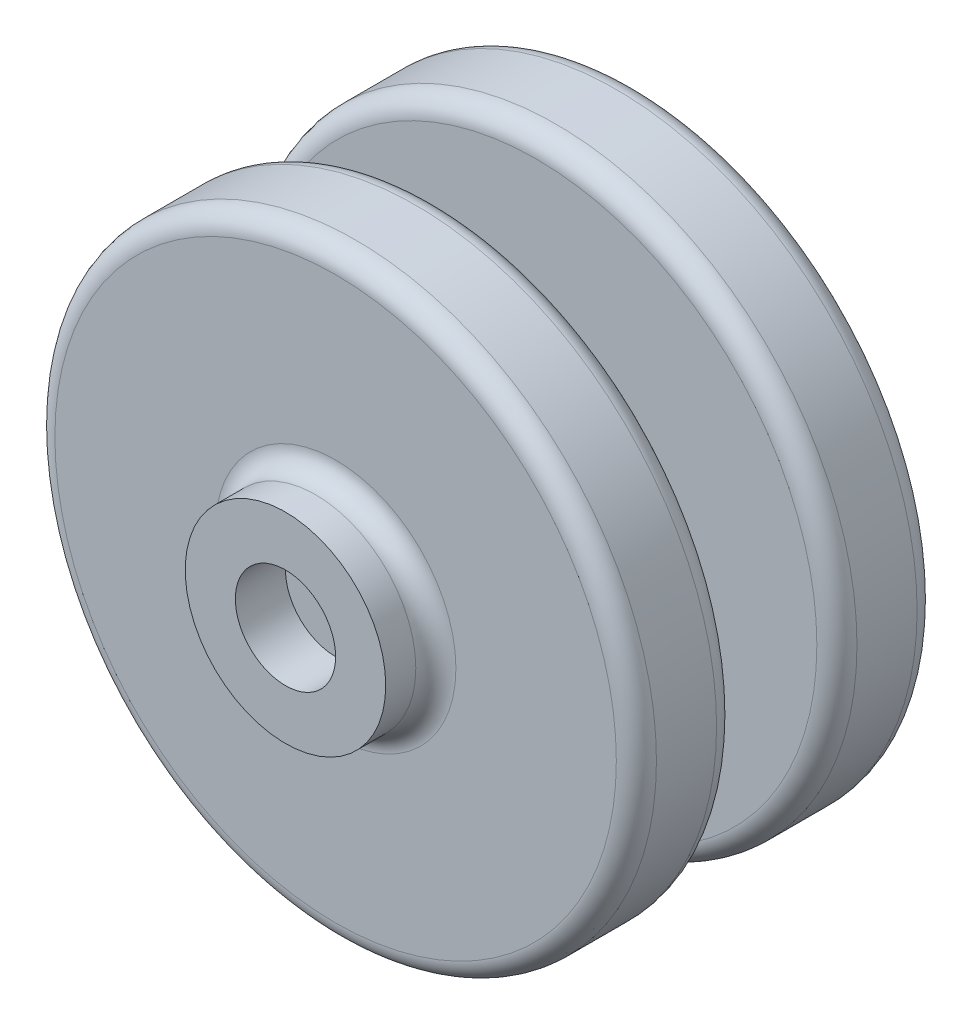
ISO-10303-21;
HEADER;
FILE_DESCRIPTION(('STEP AP214'),'2;1');
FILE_NAME('part.step','',(''),(''),'','','');
FILE_SCHEMA(('AUTOMOTIVE_DESIGN { 1 0 10303 214 1 1 1 1 }'));
ENDSEC;
DATA;
#1=APPLICATION_CONTEXT('core data for automotive mechanical design processes');
#2=APPLICATION_PROTOCOL_DEFINITION('international standard','automotive_design',2000,#1);
#3=PRODUCT_CONTEXT('',#1,'mechanical');
#4=PRODUCT('Part','Part','',(#3));
#5=PRODUCT_RELATED_PRODUCT_CATEGORY('part','',(#4));
#6=PRODUCT_DEFINITION_FORMATION('','',#4);
#7=PRODUCT_DEFINITION_CONTEXT('part definition',#1,'design');
#8=PRODUCT_DEFINITION('design','',#6,#7);
#9=PRODUCT_DEFINITION_SHAPE('','',#8);
#10=(LENGTH_UNIT() NAMED_UNIT(*) SI_UNIT(.MILLI.,.METRE.));
#11=(NAMED_UNIT(*) PLANE_ANGLE_UNIT() SI_UNIT($,.RADIAN.));
#12=(NAMED_UNIT(*) SI_UNIT($,.STERADIAN.) SOLID_ANGLE_UNIT());
#13=UNCERTAINTY_MEASURE_WITH_UNIT(LENGTH_MEASURE(1.E-05),#10,'distance_accuracy_value','');
#14=(GEOMETRIC_REPRESENTATION_CONTEXT(3) GLOBAL_UNCERTAINTY_ASSIGNED_CONTEXT((#13)) GLOBAL_UNIT_ASSIGNED_CONTEXT((#10,
#11,#12)) REPRESENTATION_CONTEXT('',''));
#15=CARTESIAN_POINT('',(0.,0.,0.));
#16=DIRECTION('',(0.,0.,1.));
#17=DIRECTION('',(1.,0.,0.));
#18=AXIS2_PLACEMENT_3D('',#15,#16,#17);
#19=CARTESIAN_POINT('',(0.,0.,10.));
#20=DIRECTION('',(0.,0.,-1.));
#21=DIRECTION('',(-1.,0.,0.));
#22=AXIS2_PLACEMENT_3D('',#19,#20,#21);
#23=CYLINDRICAL_SURFACE('',#22,30.);
#24=CARTESIAN_POINT('',(0.,0.,8.));
#25=DIRECTION('',(0.,0.,1.));
#26=DIRECTION('',(1.,0.,0.));
#27=AXIS2_PLACEMENT_3D('',#24,#25,#26);
#28=CIRCLE('',#27,30.);
#29=CARTESIAN_POINT('',(30.,0.,8.));
#30=VERTEX_POINT('',#29);
#31=EDGE_CURVE('E45',#30,#30,#28,.F.);
#32=ORIENTED_EDGE('',*,*,#31,.T.);
#33=EDGE_LOOP('',(#32));
#34=FACE_BOUND('',#33,.T.);
#35=CARTESIAN_POINT('',(0.,0.,2.));
#36=DIRECTION('',(0.,0.,1.));
#37=DIRECTION('',(1.,0.,0.));
#38=AXIS2_PLACEMENT_3D('',#35,#36,#37);
#39=CIRCLE('',#38,30.);
#40=CARTESIAN_POINT('',(30.,0.,2.));
#41=VERTEX_POINT('',#40);
#42=EDGE_CURVE('E49',#41,#41,#39,.T.);
#43=ORIENTED_EDGE('',*,*,#42,.T.);
#44=EDGE_LOOP('',(#43));
#45=FACE_BOUND('',#44,.T.);
#46=ADVANCED_FACE('F38',(#34,#45),#23,.T.);
#47=CARTESIAN_POINT('',(0.,0.,10.));
#48=DIRECTION('',(0.,0.,1.));
#49=DIRECTION('',(1.,0.,0.));
#50=AXIS2_PLACEMENT_3D('',#47,#48,#49);
#51=PLANE('',#50);
#52=CARTESIAN_POINT('',(0.,0.,10.));
#53=DIRECTION('',(0.,0.,1.));
#54=DIRECTION('',(1.,0.,0.));
#55=AXIS2_PLACEMENT_3D('',#52,#53,#54);
#56=CIRCLE('',#55,28.);
#57=CARTESIAN_POINT('',(28.,0.,10.));
#58=VERTEX_POINT('',#57);
#59=EDGE_CURVE('E53',#58,#58,#56,.T.);
#60=ORIENTED_EDGE('',*,*,#59,.T.);
#61=EDGE_LOOP('',(#60));
#62=FACE_BOUND('',#61,.T.);
#63=CARTESIAN_POINT('',(0.,0.,10.));
#64=DIRECTION('',(0.,0.,1.));
#65=DIRECTION('',(1.,0.,0.));
#66=AXIS2_PLACEMENT_3D('',#63,#64,#65);
#67=CIRCLE('',#66,5.);
#68=CARTESIAN_POINT('',(5.,0.,10.));
#69=VERTEX_POINT('',#68);
#70=EDGE_CURVE('E88',#69,#69,#67,.T.);
#71=ORIENTED_EDGE('',*,*,#70,.F.);
#72=EDGE_LOOP('',(#71));
#73=FACE_BOUND('',#72,.T.);
#74=ADVANCED_FACE('F131',(#62,#73),#51,.T.);
#75=CARTESIAN_POINT('',(0.,0.,0.));
#76=DIRECTION('',(0.,0.,1.));
#77=DIRECTION('',(1.,0.,0.));
#78=AXIS2_PLACEMENT_3D('',#75,#76,#77);
#79=PLANE('',#78);
#80=CARTESIAN_POINT('',(0.,0.,0.));
#81=DIRECTION('',(0.,0.,1.));
#82=DIRECTION('',(1.,0.,0.));
#83=AXIS2_PLACEMENT_3D('',#80,#81,#82);
#84=CIRCLE('',#83,28.);
#85=CARTESIAN_POINT('',(28.,0.,0.));
#86=VERTEX_POINT('',#85);
#87=EDGE_CURVE('E10',#86,#86,#84,.F.);
#88=ORIENTED_EDGE('',*,*,#87,.T.);
#89=EDGE_LOOP('',(#88));
#90=FACE_BOUND('',#89,.T.);
#91=CARTESIAN_POINT('',(0.,0.,0.));
#92=DIRECTION('',(0.,0.,1.));
#93=DIRECTION('',(1.,0.,0.));
#94=AXIS2_PLACEMENT_3D('',#91,#92,#93);
#95=CIRCLE('',#94,12.);
#96=CARTESIAN_POINT('',(12.,0.,0.));
#97=VERTEX_POINT('',#96);
#98=EDGE_CURVE('E79',#97,#97,#95,.T.);
#99=ORIENTED_EDGE('',*,*,#98,.T.);
#100=EDGE_LOOP('',(#99));
#101=FACE_BOUND('',#100,.T.);
#102=ADVANCED_FACE('F120',(#90,#101),#79,.F.);
#103=CARTESIAN_POINT('',(0.,0.,20.));
#104=DIRECTION('',(0.,0.,-1.));
#105=DIRECTION('',(-1.,0.,0.));
#106=AXIS2_PLACEMENT_3D('',#103,#104,#105);
#107=CYLINDRICAL_SURFACE('',#106,5.);
#108=CARTESIAN_POINT('',(0.,0.,20.));
#109=DIRECTION('',(0.,0.,1.));
#110=DIRECTION('',(1.,0.,0.));
#111=AXIS2_PLACEMENT_3D('',#108,#109,#110);
#112=CIRCLE('',#111,5.);
#113=CARTESIAN_POINT('',(5.,0.,20.));
#114=VERTEX_POINT('',#113);
#115=EDGE_CURVE('E91',#114,#114,#112,.T.);
#116=ORIENTED_EDGE('',*,*,#115,.F.);
#117=EDGE_LOOP('',(#116));
#118=FACE_BOUND('',#117,.T.);
#119=ORIENTED_EDGE('',*,*,#70,.T.);
#120=EDGE_LOOP('',(#119));
#121=FACE_BOUND('',#120,.T.);
#122=ADVANCED_FACE('F130',(#118,#121),#107,.T.);
#123=CARTESIAN_POINT('',(0.,0.,30.));
#124=DIRECTION('',(0.,0.,-1.));
#125=DIRECTION('',(-1.,0.,0.));
#126=AXIS2_PLACEMENT_3D('',#123,#124,#125);
#127=CYLINDRICAL_SURFACE('',#126,30.);
#128=CARTESIAN_POINT('',(0.,0.,28.));
#129=DIRECTION('',(0.,0.,1.));
#130=DIRECTION('',(1.,0.,0.));
#131=AXIS2_PLACEMENT_3D('',#128,#129,#130);
#132=CIRCLE('',#131,30.);
#133=CARTESIAN_POINT('',(30.,0.,28.));
#134=VERTEX_POINT('',#133);
#135=EDGE_CURVE('E61',#134,#134,#132,.F.);
#136=ORIENTED_EDGE('',*,*,#135,.T.);
#137=EDGE_LOOP('',(#136));
#138=FACE_BOUND('',#137,.T.);
#139=CARTESIAN_POINT('',(0.,0.,22.));
#140=DIRECTION('',(0.,0.,1.));
#141=DIRECTION('',(1.,0.,0.));
#142=AXIS2_PLACEMENT_3D('',#139,#140,#141);
#143=CIRCLE('',#142,30.);
#144=CARTESIAN_POINT('',(30.,0.,22.));
#145=VERTEX_POINT('',#144);
#146=EDGE_CURVE('E64',#145,#145,#143,.T.);
#147=ORIENTED_EDGE('',*,*,#146,.T.);
#148=EDGE_LOOP('',(#147));
#149=FACE_BOUND('',#148,.T.);
#150=ADVANCED_FACE('F162',(#138,#149),#127,.T.);
#151=CARTESIAN_POINT('',(0.,0.,30.));
#152=DIRECTION('',(0.,0.,1.));
#153=DIRECTION('',(1.,0.,0.));
#154=AXIS2_PLACEMENT_3D('',#151,#152,#153);
#155=PLANE('',#154);
#156=CARTESIAN_POINT('',(0.,0.,30.));
#157=DIRECTION('',(0.,0.,1.));
#158=DIRECTION('',(1.,0.,0.));
#159=AXIS2_PLACEMENT_3D('',#156,#157,#158);
#160=CIRCLE('',#159,28.);
#161=CARTESIAN_POINT('',(28.,0.,30.));
#162=VERTEX_POINT('',#161);
#163=EDGE_CURVE('E67',#162,#162,#160,.T.);
#164=ORIENTED_EDGE('',*,*,#163,.T.);
#165=EDGE_LOOP('',(#164));
#166=FACE_BOUND('',#165,.T.);
#167=CARTESIAN_POINT('',(0.,0.,30.));
#168=DIRECTION('',(0.,0.,1.));
#169=DIRECTION('',(1.,0.,0.));
#170=AXIS2_PLACEMENT_3D('',#167,#168,#169);
#171=CIRCLE('',#170,12.);
#172=CARTESIAN_POINT('',(12.,0.,30.));
#173=VERTEX_POINT('',#172);
#174=EDGE_CURVE('E70',#173,#173,#171,.F.);
#175=ORIENTED_EDGE('',*,*,#174,.T.);
#176=EDGE_LOOP('',(#175));
#177=FACE_BOUND('',#176,.T.);
#178=ADVANCED_FACE('F168',(#166,#177),#155,.T.);
#179=CARTESIAN_POINT('',(0.,0.,20.));
#180=DIRECTION('',(0.,0.,1.));
#181=DIRECTION('',(1.,0.,0.));
#182=AXIS2_PLACEMENT_3D('',#179,#180,#181);
#183=PLANE('',#182);
#184=CARTESIAN_POINT('',(0.,0.,20.));
#185=DIRECTION('',(0.,0.,1.));
#186=DIRECTION('',(1.,0.,0.));
#187=AXIS2_PLACEMENT_3D('',#184,#185,#186);
#188=CIRCLE('',#187,28.);
#189=CARTESIAN_POINT('',(28.,0.,20.));
#190=VERTEX_POINT('',#189);
#191=EDGE_CURVE('E58',#190,#190,#188,.F.);
#192=ORIENTED_EDGE('',*,*,#191,.T.);
#193=EDGE_LOOP('',(#192));
#194=FACE_BOUND('',#193,.T.);
#195=ORIENTED_EDGE('',*,*,#115,.T.);
#196=EDGE_LOOP('',(#195));
#197=FACE_BOUND('',#196,.T.);
#198=ADVANCED_FACE('F173',(#194,#197),#183,.F.);
#199=CARTESIAN_POINT('',(0.,0.,35.));
#200=DIRECTION('',(0.,0.,1.));
#201=DIRECTION('',(1.,0.,0.));
#202=AXIS2_PLACEMENT_3D('',#199,#200,#201);
#203=PLANE('',#202);
#204=CARTESIAN_POINT('',(0.,0.,35.));
#205=DIRECTION('',(0.,0.,1.));
#206=DIRECTION('',(1.,0.,0.));
#207=AXIS2_PLACEMENT_3D('',#204,#205,#206);
#208=CIRCLE('',#207,10.);
#209=CARTESIAN_POINT('',(10.,0.,35.));
#210=VERTEX_POINT('',#209);
#211=EDGE_CURVE('E94',#210,#210,#208,.T.);
#212=ORIENTED_EDGE('',*,*,#211,.T.);
#213=EDGE_LOOP('',(#212));
#214=FACE_BOUND('',#213,.T.);
#215=CARTESIAN_POINT('',(0.,0.,35.));
#216=DIRECTION('',(0.,0.,1.));
#217=DIRECTION('',(1.,0.,0.));
#218=AXIS2_PLACEMENT_3D('',#215,#216,#217);
#219=CIRCLE('',#218,5.);
#220=CARTESIAN_POINT('',(5.,0.,35.));
#221=VERTEX_POINT('',#220);
#222=EDGE_CURVE('E97',#221,#221,#219,.T.);
#223=ORIENTED_EDGE('',*,*,#222,.F.);
#224=EDGE_LOOP('',(#223));
#225=FACE_BOUND('',#224,.T.);
#226=ADVANCED_FACE('F176',(#214,#225),#203,.T.);
#227=CARTESIAN_POINT('',(0.,0.,35.));
#228=DIRECTION('',(0.,0.,-1.));
#229=DIRECTION('',(-1.,0.,0.));
#230=AXIS2_PLACEMENT_3D('',#227,#228,#229);
#231=CYLINDRICAL_SURFACE('',#230,10.);
#232=CARTESIAN_POINT('',(0.,0.,32.));
#233=DIRECTION('',(0.,0.,1.));
#234=DIRECTION('',(1.,0.,0.));
#235=AXIS2_PLACEMENT_3D('',#232,#233,#234);
#236=CIRCLE('',#235,10.);
#237=CARTESIAN_POINT('',(10.,0.,32.));
#238=VERTEX_POINT('',#237);
#239=EDGE_CURVE('E73',#238,#238,#236,.T.);
#240=ORIENTED_EDGE('',*,*,#239,.T.);
#241=EDGE_LOOP('',(#240));
#242=FACE_BOUND('',#241,.T.);
#243=ORIENTED_EDGE('',*,*,#211,.F.);
#244=EDGE_LOOP('',(#243));
#245=FACE_BOUND('',#244,.T.);
#246=ADVANCED_FACE('F182',(#242,#245),#231,.T.);
#247=CARTESIAN_POINT('',(0.,0.,35.));
#248=DIRECTION('',(0.,0.,-1.));
#249=DIRECTION('',(-1.,0.,0.));
#250=AXIS2_PLACEMENT_3D('',#247,#248,#249);
#251=CYLINDRICAL_SURFACE('',#250,5.);
#252=ORIENTED_EDGE('',*,*,#222,.T.);
#253=EDGE_LOOP('',(#252));
#254=FACE_BOUND('',#253,.T.);
#255=CARTESIAN_POINT('',(0.,0.,30.));
#256=DIRECTION('',(0.,0.,1.));
#257=DIRECTION('',(1.,0.,0.));
#258=AXIS2_PLACEMENT_3D('',#255,#256,#257);
#259=CIRCLE('',#258,5.);
#260=CARTESIAN_POINT('',(5.,0.,30.));
#261=VERTEX_POINT('',#260);
#262=EDGE_CURVE('E85',#261,#261,#259,.F.);
#263=ORIENTED_EDGE('',*,*,#262,.T.);
#264=EDGE_LOOP('',(#263));
#265=FACE_BOUND('',#264,.T.);
#266=ADVANCED_FACE('F185',(#254,#265),#251,.F.);
#267=ORIENTED_EDGE('',*,*,#262,.F.);
#268=EDGE_LOOP('',(#267));
#269=FACE_BOUND('',#268,.T.);
#270=ADVANCED_FACE('F181',(#269),#155,.T.);
#271=CARTESIAN_POINT('',(0.,0.,-5.));
#272=DIRECTION('',(0.,0.,1.));
#273=DIRECTION('',(1.,0.,0.));
#274=AXIS2_PLACEMENT_3D('',#271,#272,#273);
#275=CYLINDRICAL_SURFACE('',#274,10.);
#276=CARTESIAN_POINT('',(0.,0.,-2.));
#277=DIRECTION('',(0.,0.,1.));
#278=DIRECTION('',(1.,0.,0.));
#279=AXIS2_PLACEMENT_3D('',#276,#277,#278);
#280=CIRCLE('',#279,10.);
#281=CARTESIAN_POINT('',(10.,0.,-2.));
#282=VERTEX_POINT('',#281);
#283=EDGE_CURVE('E76',#282,#282,#280,.F.);
#284=ORIENTED_EDGE('',*,*,#283,.T.);
#285=EDGE_LOOP('',(#284));
#286=FACE_BOUND('',#285,.T.);
#287=CARTESIAN_POINT('',(0.,0.,-5.));
#288=DIRECTION('',(0.,0.,1.));
#289=DIRECTION('',(1.,0.,0.));
#290=AXIS2_PLACEMENT_3D('',#287,#288,#289);
#291=CIRCLE('',#290,10.);
#292=CARTESIAN_POINT('',(10.,0.,-5.));
#293=VERTEX_POINT('',#292);
#294=EDGE_CURVE('E100',#293,#293,#291,.T.);
#295=ORIENTED_EDGE('',*,*,#294,.T.);
#296=EDGE_LOOP('',(#295));
#297=FACE_BOUND('',#296,.T.);
#298=ADVANCED_FACE('F193',(#286,#297),#275,.T.);
#299=CARTESIAN_POINT('',(0.,0.,-5.));
#300=DIRECTION('',(0.,0.,-1.));
#301=DIRECTION('',(1.,0.,0.));
#302=AXIS2_PLACEMENT_3D('',#299,#300,#301);
#303=PLANE('',#302);
#304=CARTESIAN_POINT('',(0.,0.,-5.));
#305=DIRECTION('',(0.,0.,1.));
#306=DIRECTION('',(1.,0.,0.));
#307=AXIS2_PLACEMENT_3D('',#304,#305,#306);
#308=CIRCLE('',#307,5.);
#309=CARTESIAN_POINT('',(5.,0.,-5.));
#310=VERTEX_POINT('',#309);
#311=EDGE_CURVE('E103',#310,#310,#308,.T.);
#312=ORIENTED_EDGE('',*,*,#311,.T.);
#313=EDGE_LOOP('',(#312));
#314=FACE_BOUND('',#313,.T.);
#315=ORIENTED_EDGE('',*,*,#294,.F.);
#316=EDGE_LOOP('',(#315));
#317=FACE_BOUND('',#316,.T.);
#318=ADVANCED_FACE('F107',(#314,#317),#303,.T.);
#319=CARTESIAN_POINT('',(0.,0.,-5.));
#320=DIRECTION('',(0.,0.,1.));
#321=DIRECTION('',(1.,0.,0.));
#322=AXIS2_PLACEMENT_3D('',#319,#320,#321);
#323=CYLINDRICAL_SURFACE('',#322,5.);
#324=ORIENTED_EDGE('',*,*,#311,.F.);
#325=EDGE_LOOP('',(#324));
#326=FACE_BOUND('',#325,.T.);
#327=CARTESIAN_POINT('',(0.,0.,0.));
#328=DIRECTION('',(0.,0.,1.));
#329=DIRECTION('',(1.,0.,0.));
#330=AXIS2_PLACEMENT_3D('',#327,#328,#329);
#331=CIRCLE('',#330,5.);
#332=CARTESIAN_POINT('',(5.,0.,0.));
#333=VERTEX_POINT('',#332);
#334=EDGE_CURVE('E82',#333,#333,#331,.T.);
#335=ORIENTED_EDGE('',*,*,#334,.T.);
#336=EDGE_LOOP('',(#335));
#337=FACE_BOUND('',#336,.T.);
#338=ADVANCED_FACE('F110',(#326,#337),#323,.F.);
#339=ORIENTED_EDGE('',*,*,#334,.F.);
#340=EDGE_LOOP('',(#339));
#341=FACE_BOUND('',#340,.T.);
#342=ADVANCED_FACE('F113',(#341),#79,.F.);
#343=CARTESIAN_POINT('',(0.,0.,-2.));
#344=DIRECTION('',(0.,0.,1.));
#345=DIRECTION('',(1.,0.,0.));
#346=AXIS2_PLACEMENT_3D('',#343,#344,#345);
#347=TOROIDAL_SURFACE('',#346,12.,2.);
#348=ORIENTED_EDGE('',*,*,#283,.F.);
#349=EDGE_LOOP('',(#348));
#350=FACE_BOUND('',#349,.T.);
#351=ORIENTED_EDGE('',*,*,#98,.F.);
#352=EDGE_LOOP('',(#351));
#353=FACE_BOUND('',#352,.T.);
#354=ADVANCED_FACE('F118',(#350,#353),#347,.F.);
#355=CARTESIAN_POINT('',(0.,0.,32.));
#356=DIRECTION('',(0.,0.,1.));
#357=DIRECTION('',(1.,0.,0.));
#358=AXIS2_PLACEMENT_3D('',#355,#356,#357);
#359=TOROIDAL_SURFACE('',#358,12.,2.);
#360=ORIENTED_EDGE('',*,*,#174,.F.);
#361=EDGE_LOOP('',(#360));
#362=FACE_BOUND('',#361,.T.);
#363=ORIENTED_EDGE('',*,*,#239,.F.);
#364=EDGE_LOOP('',(#363));
#365=FACE_BOUND('',#364,.T.);
#366=ADVANCED_FACE('F124',(#362,#365),#359,.F.);
#367=CARTESIAN_POINT('',(0.,0.,28.));
#368=DIRECTION('',(0.,0.,1.));
#369=DIRECTION('',(1.,0.,0.));
#370=AXIS2_PLACEMENT_3D('',#367,#368,#369);
#371=TOROIDAL_SURFACE('',#370,28.,2.);
#372=ORIENTED_EDGE('',*,*,#135,.F.);
#373=EDGE_LOOP('',(#372));
#374=FACE_BOUND('',#373,.T.);
#375=ORIENTED_EDGE('',*,*,#163,.F.);
#376=EDGE_LOOP('',(#375));
#377=FACE_BOUND('',#376,.T.);
#378=ADVANCED_FACE('F141',(#374,#377),#371,.T.);
#379=CARTESIAN_POINT('',(0.,0.,22.));
#380=DIRECTION('',(0.,0.,1.));
#381=DIRECTION('',(1.,0.,0.));
#382=AXIS2_PLACEMENT_3D('',#379,#380,#381);
#383=TOROIDAL_SURFACE('',#382,28.,2.);
#384=ORIENTED_EDGE('',*,*,#191,.F.);
#385=EDGE_LOOP('',(#384));
#386=FACE_BOUND('',#385,.T.);
#387=ORIENTED_EDGE('',*,*,#146,.F.);
#388=EDGE_LOOP('',(#387));
#389=FACE_BOUND('',#388,.T.);
#390=ADVANCED_FACE('F145',(#386,#389),#383,.T.);
#391=CARTESIAN_POINT('',(0.,0.,8.));
#392=DIRECTION('',(0.,0.,1.));
#393=DIRECTION('',(1.,0.,0.));
#394=AXIS2_PLACEMENT_3D('',#391,#392,#393);
#395=TOROIDAL_SURFACE('',#394,28.,2.);
#396=ORIENTED_EDGE('',*,*,#31,.F.);
#397=EDGE_LOOP('',(#396));
#398=FACE_BOUND('',#397,.T.);
#399=ORIENTED_EDGE('',*,*,#59,.F.);
#400=EDGE_LOOP('',(#399));
#401=FACE_BOUND('',#400,.T.);
#402=ADVANCED_FACE('F148',(#398,#401),#395,.T.);
#403=CARTESIAN_POINT('',(0.,0.,2.));
#404=DIRECTION('',(0.,0.,1.));
#405=DIRECTION('',(1.,0.,0.));
#406=AXIS2_PLACEMENT_3D('',#403,#404,#405);
#407=TOROIDAL_SURFACE('',#406,28.,2.);
#408=ORIENTED_EDGE('',*,*,#87,.F.);
#409=EDGE_LOOP('',(#408));
#410=FACE_BOUND('',#409,.T.);
#411=ORIENTED_EDGE('',*,*,#42,.F.);
#412=EDGE_LOOP('',(#411));
#413=FACE_BOUND('',#412,.T.);
#414=ADVANCED_FACE('F40',(#410,#413),#407,.T.);
#415=CLOSED_SHELL('',(#46,#74,#102,#122,#150,#178,#198,#226,#246,#266,#270,#298,#318,#338,#342,
#354,#366,#378,#390,#402,#414));
#416=MANIFOLD_SOLID_BREP('B2',#415);
#417=ADVANCED_BREP_SHAPE_REPRESENTATION('',(#18,#416),#14);
#418=SHAPE_DEFINITION_REPRESENTATION(#9,#417);
ENDSEC;
END-ISO-10303-21;
